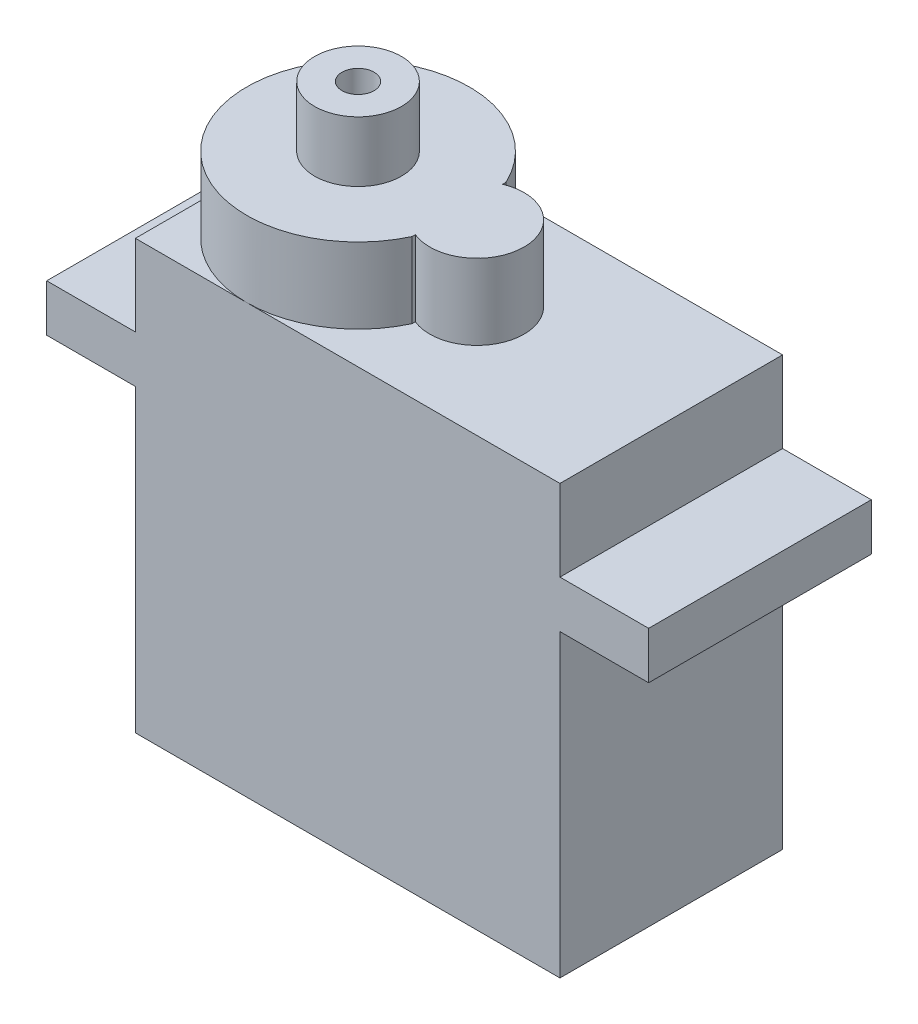
ISO-10303-21;
HEADER;
FILE_DESCRIPTION(('STEP AP214'),'2;1');
FILE_NAME('part.step','',(''),(''),'','','');
FILE_SCHEMA(('AUTOMOTIVE_DESIGN { 1 0 10303 214 1 1 1 1 }'));
ENDSEC;
DATA;
#1=APPLICATION_CONTEXT('core data for automotive mechanical design processes');
#2=APPLICATION_PROTOCOL_DEFINITION('international standard','automotive_design',2000,#1);
#3=PRODUCT_CONTEXT('',#1,'mechanical');
#4=PRODUCT('Part','Part','',(#3));
#5=PRODUCT_RELATED_PRODUCT_CATEGORY('part','',(#4));
#6=PRODUCT_DEFINITION_FORMATION('','',#4);
#7=PRODUCT_DEFINITION_CONTEXT('part definition',#1,'design');
#8=PRODUCT_DEFINITION('design','',#6,#7);
#9=PRODUCT_DEFINITION_SHAPE('','',#8);
#10=(LENGTH_UNIT() NAMED_UNIT(*) SI_UNIT(.MILLI.,.METRE.));
#11=(NAMED_UNIT(*) PLANE_ANGLE_UNIT() SI_UNIT($,.RADIAN.));
#12=(NAMED_UNIT(*) SI_UNIT($,.STERADIAN.) SOLID_ANGLE_UNIT());
#13=UNCERTAINTY_MEASURE_WITH_UNIT(LENGTH_MEASURE(1.E-05),#10,'distance_accuracy_value','');
#14=(GEOMETRIC_REPRESENTATION_CONTEXT(3) GLOBAL_UNCERTAINTY_ASSIGNED_CONTEXT((#13)) GLOBAL_UNIT_ASSIGNED_CONTEXT((#10,
#11,#12)) REPRESENTATION_CONTEXT('',''));
#15=CARTESIAN_POINT('',(0.,0.,0.));
#16=DIRECTION('',(0.,0.,1.));
#17=DIRECTION('',(1.,0.,0.));
#18=AXIS2_PLACEMENT_3D('',#15,#16,#17);
#19=CARTESIAN_POINT('',(0.,11.35,11.8));
#20=DIRECTION('',(0.,1.,0.));
#21=DIRECTION('',(0.,0.,1.));
#22=AXIS2_PLACEMENT_3D('',#19,#20,#21);
#23=PLANE('',#22);
#24=CARTESIAN_POINT('',(-5.35,11.35,5.9));
#25=DIRECTION('',(0.,1.,0.));
#26=DIRECTION('',(0.,0.,1.));
#27=AXIS2_PLACEMENT_3D('',#24,#25,#26);
#28=CIRCLE('',#27,5.9);
#29=CARTESIAN_POINT('',(-11.25,11.35,5.9));
#30=VERTEX_POINT('',#29);
#31=CARTESIAN_POINT('',(-5.35,11.35,11.8));
#32=VERTEX_POINT('',#31);
#33=EDGE_CURVE('E54',#30,#32,#28,.T.);
#34=ORIENTED_EDGE('',*,*,#33,.F.);
#35=DIRECTION('',(0.,0.,-1.));
#36=VECTOR('',#35,1.);
#37=CARTESIAN_POINT('',(-11.25,11.35,11.8));
#38=LINE('',#37,#36);
#39=CARTESIAN_POINT('',(-11.25,11.35,11.8));
#40=VERTEX_POINT('',#39);
#41=EDGE_CURVE('E181',#40,#30,#38,.T.);
#42=ORIENTED_EDGE('',*,*,#41,.F.);
#43=DIRECTION('',(1.,0.,0.));
#44=VECTOR('',#43,1.);
#45=CARTESIAN_POINT('',(0.,11.35,11.8));
#46=LINE('',#45,#44);
#47=EDGE_CURVE('E164',#40,#32,#46,.T.);
#48=ORIENTED_EDGE('',*,*,#47,.T.);
#49=EDGE_LOOP('',(#34,#42,#48));
#50=FACE_BOUND('',#49,.T.);
#51=ADVANCED_FACE('F45',(#50),#23,.T.);
#52=CARTESIAN_POINT('',(0.,11.35,8.38746859276656));
#53=VERTEX_POINT('',#52);
#54=EDGE_CURVE('E159',#32,#53,#28,.T.);
#55=ORIENTED_EDGE('',*,*,#54,.F.);
#56=CARTESIAN_POINT('',(11.25,11.35,11.8));
#57=VERTEX_POINT('',#56);
#58=EDGE_CURVE('E150',#32,#57,#46,.T.);
#59=ORIENTED_EDGE('',*,*,#58,.T.);
#60=DIRECTION('',(0.,0.,-1.));
#61=VECTOR('',#60,1.);
#62=CARTESIAN_POINT('',(11.25,11.35,11.8));
#63=LINE('',#62,#61);
#64=CARTESIAN_POINT('',(11.25,11.35,0.));
#65=VERTEX_POINT('',#64);
#66=EDGE_CURVE('E155',#57,#65,#63,.T.);
#67=ORIENTED_EDGE('',*,*,#66,.T.);
#68=DIRECTION('',(1.,0.,0.));
#69=VECTOR('',#68,1.);
#70=CARTESIAN_POINT('',(0.,11.35,0.));
#71=LINE('',#70,#69);
#72=CARTESIAN_POINT('',(-5.35,11.35,0.));
#73=VERTEX_POINT('',#72);
#74=EDGE_CURVE('E298',#73,#65,#71,.T.);
#75=ORIENTED_EDGE('',*,*,#74,.F.);
#76=CARTESIAN_POINT('',(0.,11.35,3.41253140723345));
#77=VERTEX_POINT('',#76);
#78=EDGE_CURVE('E223',#77,#73,#28,.T.);
#79=ORIENTED_EDGE('',*,*,#78,.F.);
#80=DIRECTION('',(0.,0.,1.));
#81=VECTOR('',#80,1.);
#82=CARTESIAN_POINT('',(0.,11.35,0.));
#83=LINE('',#82,#81);
#84=CARTESIAN_POINT('',(0.,11.35,3.58753378403056));
#85=VERTEX_POINT('',#84);
#86=EDGE_CURVE('E235',#77,#85,#83,.T.);
#87=ORIENTED_EDGE('',*,*,#86,.T.);
#88=CARTESIAN_POINT('',(0.949999999999996,11.35,5.9));
#89=DIRECTION('',(0.,1.,0.));
#90=DIRECTION('',(0.,0.,1.));
#91=AXIS2_PLACEMENT_3D('',#88,#89,#90);
#92=CIRCLE('',#91,2.5);
#93=CARTESIAN_POINT('',(0.,11.35,8.21246621596944));
#94=VERTEX_POINT('',#93);
#95=EDGE_CURVE('E61',#94,#85,#92,.T.);
#96=ORIENTED_EDGE('',*,*,#95,.F.);
#97=DIRECTION('',(0.,0.,1.));
#98=VECTOR('',#97,1.);
#99=CARTESIAN_POINT('',(0.,11.35,0.));
#100=LINE('',#99,#98);
#101=EDGE_CURVE('E234',#94,#53,#100,.T.);
#102=ORIENTED_EDGE('',*,*,#101,.T.);
#103=EDGE_LOOP('',(#55,#59,#67,#75,#79,#87,#96,#102));
#104=FACE_BOUND('',#103,.T.);
#105=ADVANCED_FACE('F152',(#104),#23,.T.);
#106=CARTESIAN_POINT('',(0.,7.05,11.8));
#107=DIRECTION('',(0.,1.,0.));
#108=DIRECTION('',(-1.,0.,0.));
#109=AXIS2_PLACEMENT_3D('',#106,#107,#108);
#110=PLANE('',#109);
#111=DIRECTION('',(1.,0.,0.));
#112=VECTOR('',#111,1.);
#113=CARTESIAN_POINT('',(0.,7.05,0.));
#114=LINE('',#113,#112);
#115=CARTESIAN_POINT('',(-15.95,7.05,0.));
#116=VERTEX_POINT('',#115);
#117=CARTESIAN_POINT('',(-11.25,7.05,0.));
#118=VERTEX_POINT('',#117);
#119=EDGE_CURVE('E265',#116,#118,#114,.T.);
#120=ORIENTED_EDGE('',*,*,#119,.F.);
#121=DIRECTION('',(0.,0.,-1.));
#122=VECTOR('',#121,1.);
#123=CARTESIAN_POINT('',(-15.95,7.05,11.8));
#124=LINE('',#123,#122);
#125=CARTESIAN_POINT('',(-15.95,7.05,11.8));
#126=VERTEX_POINT('',#125);
#127=EDGE_CURVE('E118',#126,#116,#124,.T.);
#128=ORIENTED_EDGE('',*,*,#127,.F.);
#129=DIRECTION('',(1.,0.,0.));
#130=VECTOR('',#129,1.);
#131=CARTESIAN_POINT('',(0.,7.05,11.8));
#132=LINE('',#131,#130);
#133=CARTESIAN_POINT('',(-11.25,7.05,11.8));
#134=VERTEX_POINT('',#133);
#135=EDGE_CURVE('E303',#126,#134,#132,.T.);
#136=ORIENTED_EDGE('',*,*,#135,.T.);
#137=DIRECTION('',(0.,0.,-1.));
#138=VECTOR('',#137,1.);
#139=CARTESIAN_POINT('',(-11.25,7.05,11.8));
#140=LINE('',#139,#138);
#141=EDGE_CURVE('E70',#134,#118,#140,.T.);
#142=ORIENTED_EDGE('',*,*,#141,.T.);
#143=EDGE_LOOP('',(#120,#128,#136,#142));
#144=FACE_BOUND('',#143,.T.);
#145=ADVANCED_FACE('F47',(#144),#110,.T.);
#146=CARTESIAN_POINT('',(-15.95,0.,11.8));
#147=DIRECTION('',(-1.,0.,0.));
#148=DIRECTION('',(0.,0.,1.));
#149=AXIS2_PLACEMENT_3D('',#146,#147,#148);
#150=PLANE('',#149);
#151=DIRECTION('',(0.,1.,0.));
#152=VECTOR('',#151,1.);
#153=CARTESIAN_POINT('',(-15.95,0.,0.));
#154=LINE('',#153,#152);
#155=CARTESIAN_POINT('',(-15.95,4.55,0.));
#156=VERTEX_POINT('',#155);
#157=EDGE_CURVE('E268',#156,#116,#154,.T.);
#158=ORIENTED_EDGE('',*,*,#157,.F.);
#159=DIRECTION('',(0.,0.,-1.));
#160=VECTOR('',#159,1.);
#161=CARTESIAN_POINT('',(-15.95,4.55,11.8));
#162=LINE('',#161,#160);
#163=CARTESIAN_POINT('',(-15.95,4.55,11.8));
#164=VERTEX_POINT('',#163);
#165=EDGE_CURVE('E213',#164,#156,#162,.T.);
#166=ORIENTED_EDGE('',*,*,#165,.F.);
#167=DIRECTION('',(0.,1.,0.));
#168=VECTOR('',#167,1.);
#169=CARTESIAN_POINT('',(-15.95,0.,11.8));
#170=LINE('',#169,#168);
#171=EDGE_CURVE('E306',#164,#126,#170,.T.);
#172=ORIENTED_EDGE('',*,*,#171,.T.);
#173=ORIENTED_EDGE('',*,*,#127,.T.);
#174=EDGE_LOOP('',(#158,#166,#172,#173));
#175=FACE_BOUND('',#174,.T.);
#176=ADVANCED_FACE('F451',(#175),#150,.T.);
#177=CARTESIAN_POINT('',(0.,4.55,11.8));
#178=DIRECTION('',(0.,-1.,0.));
#179=DIRECTION('',(1.,0.,0.));
#180=AXIS2_PLACEMENT_3D('',#177,#178,#179);
#181=PLANE('',#180);
#182=DIRECTION('',(-1.,0.,0.));
#183=VECTOR('',#182,1.);
#184=CARTESIAN_POINT('',(0.,4.55,0.));
#185=LINE('',#184,#183);
#186=CARTESIAN_POINT('',(-11.25,4.55,0.));
#187=VERTEX_POINT('',#186);
#188=EDGE_CURVE('E273',#187,#156,#185,.T.);
#189=ORIENTED_EDGE('',*,*,#188,.F.);
#190=DIRECTION('',(0.,0.,-1.));
#191=VECTOR('',#190,1.);
#192=CARTESIAN_POINT('',(-11.25,4.55,11.8));
#193=LINE('',#192,#191);
#194=CARTESIAN_POINT('',(-11.25,4.55,11.8));
#195=VERTEX_POINT('',#194);
#196=EDGE_CURVE('E210',#195,#187,#193,.T.);
#197=ORIENTED_EDGE('',*,*,#196,.F.);
#198=DIRECTION('',(-1.,0.,0.));
#199=VECTOR('',#198,1.);
#200=CARTESIAN_POINT('',(0.,4.55,11.8));
#201=LINE('',#200,#199);
#202=EDGE_CURVE('E309',#195,#164,#201,.T.);
#203=ORIENTED_EDGE('',*,*,#202,.T.);
#204=ORIENTED_EDGE('',*,*,#165,.T.);
#205=EDGE_LOOP('',(#189,#197,#203,#204));
#206=FACE_BOUND('',#205,.T.);
#207=ADVANCED_FACE('F448',(#206),#181,.T.);
#208=CARTESIAN_POINT('',(-11.25,0.,11.8));
#209=DIRECTION('',(-1.,0.,0.));
#210=DIRECTION('',(0.,0.,1.));
#211=AXIS2_PLACEMENT_3D('',#208,#209,#210);
#212=PLANE('',#211);
#213=DIRECTION('',(0.,1.,0.));
#214=VECTOR('',#213,1.);
#215=CARTESIAN_POINT('',(-11.25,0.,0.));
#216=LINE('',#215,#214);
#217=CARTESIAN_POINT('',(-11.25,-11.35,0.));
#218=VERTEX_POINT('',#217);
#219=EDGE_CURVE('E277',#218,#187,#216,.T.);
#220=ORIENTED_EDGE('',*,*,#219,.F.);
#221=DIRECTION('',(0.,0.,-1.));
#222=VECTOR('',#221,1.);
#223=CARTESIAN_POINT('',(-11.25,-11.35,11.8));
#224=LINE('',#223,#222);
#225=CARTESIAN_POINT('',(-11.25,-11.35,11.8));
#226=VERTEX_POINT('',#225);
#227=EDGE_CURVE('E207',#226,#218,#224,.T.);
#228=ORIENTED_EDGE('',*,*,#227,.F.);
#229=DIRECTION('',(0.,1.,0.));
#230=VECTOR('',#229,1.);
#231=CARTESIAN_POINT('',(-11.25,0.,11.8));
#232=LINE('',#231,#230);
#233=EDGE_CURVE('E317',#226,#195,#232,.T.);
#234=ORIENTED_EDGE('',*,*,#233,.T.);
#235=ORIENTED_EDGE('',*,*,#196,.T.);
#236=EDGE_LOOP('',(#220,#228,#234,#235));
#237=FACE_BOUND('',#236,.T.);
#238=ADVANCED_FACE('F444',(#237),#212,.T.);
#239=CARTESIAN_POINT('',(0.,-11.35,11.8));
#240=DIRECTION('',(0.,1.,0.));
#241=DIRECTION('',(0.,0.,1.));
#242=AXIS2_PLACEMENT_3D('',#239,#240,#241);
#243=PLANE('',#242);
#244=DIRECTION('',(1.,0.,0.));
#245=VECTOR('',#244,1.);
#246=CARTESIAN_POINT('',(0.,-11.35,0.));
#247=LINE('',#246,#245);
#248=CARTESIAN_POINT('',(11.25,-11.35,0.));
#249=VERTEX_POINT('',#248);
#250=EDGE_CURVE('E281',#218,#249,#247,.T.);
#251=ORIENTED_EDGE('',*,*,#250,.T.);
#252=DIRECTION('',(0.,0.,-1.));
#253=VECTOR('',#252,1.);
#254=CARTESIAN_POINT('',(11.25,-11.35,11.8));
#255=LINE('',#254,#253);
#256=CARTESIAN_POINT('',(11.25,-11.35,11.8));
#257=VERTEX_POINT('',#256);
#258=EDGE_CURVE('E203',#257,#249,#255,.T.);
#259=ORIENTED_EDGE('',*,*,#258,.F.);
#260=DIRECTION('',(1.,0.,0.));
#261=VECTOR('',#260,1.);
#262=CARTESIAN_POINT('',(0.,-11.35,11.8));
#263=LINE('',#262,#261);
#264=EDGE_CURVE('E321',#226,#257,#263,.T.);
#265=ORIENTED_EDGE('',*,*,#264,.F.);
#266=ORIENTED_EDGE('',*,*,#227,.T.);
#267=EDGE_LOOP('',(#251,#259,#265,#266));
#268=FACE_BOUND('',#267,.T.);
#269=ADVANCED_FACE('F440',(#268),#243,.F.);
#270=CARTESIAN_POINT('',(11.25,0.,11.8));
#271=DIRECTION('',(-1.,0.,0.));
#272=DIRECTION('',(0.,0.,1.));
#273=AXIS2_PLACEMENT_3D('',#270,#271,#272);
#274=PLANE('',#273);
#275=DIRECTION('',(0.,1.,0.));
#276=VECTOR('',#275,1.);
#277=CARTESIAN_POINT('',(11.25,0.,0.));
#278=LINE('',#277,#276);
#279=CARTESIAN_POINT('',(11.25,4.55,0.));
#280=VERTEX_POINT('',#279);
#281=EDGE_CURVE('E284',#249,#280,#278,.T.);
#282=ORIENTED_EDGE('',*,*,#281,.T.);
#283=DIRECTION('',(0.,0.,-1.));
#284=VECTOR('',#283,1.);
#285=CARTESIAN_POINT('',(11.25,4.55,11.8));
#286=LINE('',#285,#284);
#287=CARTESIAN_POINT('',(11.25,4.55,11.8));
#288=VERTEX_POINT('',#287);
#289=EDGE_CURVE('E199',#288,#280,#286,.T.);
#290=ORIENTED_EDGE('',*,*,#289,.F.);
#291=DIRECTION('',(0.,1.,0.));
#292=VECTOR('',#291,1.);
#293=CARTESIAN_POINT('',(11.25,0.,11.8));
#294=LINE('',#293,#292);
#295=EDGE_CURVE('E324',#257,#288,#294,.T.);
#296=ORIENTED_EDGE('',*,*,#295,.F.);
#297=ORIENTED_EDGE('',*,*,#258,.T.);
#298=EDGE_LOOP('',(#282,#290,#296,#297));
#299=FACE_BOUND('',#298,.T.);
#300=ADVANCED_FACE('F436',(#299),#274,.F.);
#301=CARTESIAN_POINT('',(0.,4.55,11.8));
#302=DIRECTION('',(0.,1.,0.));
#303=DIRECTION('',(0.,0.,1.));
#304=AXIS2_PLACEMENT_3D('',#301,#302,#303);
#305=PLANE('',#304);
#306=DIRECTION('',(1.,0.,0.));
#307=VECTOR('',#306,1.);
#308=CARTESIAN_POINT('',(0.,4.55,0.));
#309=LINE('',#308,#307);
#310=CARTESIAN_POINT('',(15.95,4.55,0.));
#311=VERTEX_POINT('',#310);
#312=EDGE_CURVE('E287',#280,#311,#309,.T.);
#313=ORIENTED_EDGE('',*,*,#312,.T.);
#314=DIRECTION('',(0.,0.,-1.));
#315=VECTOR('',#314,1.);
#316=CARTESIAN_POINT('',(15.95,4.55,11.8));
#317=LINE('',#316,#315);
#318=CARTESIAN_POINT('',(15.95,4.55,11.8));
#319=VERTEX_POINT('',#318);
#320=EDGE_CURVE('E195',#319,#311,#317,.T.);
#321=ORIENTED_EDGE('',*,*,#320,.F.);
#322=DIRECTION('',(1.,0.,0.));
#323=VECTOR('',#322,1.);
#324=CARTESIAN_POINT('',(0.,4.55,11.8));
#325=LINE('',#324,#323);
#326=EDGE_CURVE('E327',#288,#319,#325,.T.);
#327=ORIENTED_EDGE('',*,*,#326,.F.);
#328=ORIENTED_EDGE('',*,*,#289,.T.);
#329=EDGE_LOOP('',(#313,#321,#327,#328));
#330=FACE_BOUND('',#329,.T.);
#331=ADVANCED_FACE('F433',(#330),#305,.F.);
#332=CARTESIAN_POINT('',(15.95,0.,11.8));
#333=DIRECTION('',(-1.,0.,0.));
#334=DIRECTION('',(0.,0.,1.));
#335=AXIS2_PLACEMENT_3D('',#332,#333,#334);
#336=PLANE('',#335);
#337=DIRECTION('',(0.,1.,0.));
#338=VECTOR('',#337,1.);
#339=CARTESIAN_POINT('',(15.95,0.,0.));
#340=LINE('',#339,#338);
#341=CARTESIAN_POINT('',(15.95,7.05,0.));
#342=VERTEX_POINT('',#341);
#343=EDGE_CURVE('E290',#311,#342,#340,.T.);
#344=ORIENTED_EDGE('',*,*,#343,.T.);
#345=DIRECTION('',(0.,0.,-1.));
#346=VECTOR('',#345,1.);
#347=CARTESIAN_POINT('',(15.95,7.05,11.8));
#348=LINE('',#347,#346);
#349=CARTESIAN_POINT('',(15.95,7.05,11.8));
#350=VERTEX_POINT('',#349);
#351=EDGE_CURVE('E185',#350,#342,#348,.T.);
#352=ORIENTED_EDGE('',*,*,#351,.F.);
#353=DIRECTION('',(0.,1.,0.));
#354=VECTOR('',#353,1.);
#355=CARTESIAN_POINT('',(15.95,0.,11.8));
#356=LINE('',#355,#354);
#357=EDGE_CURVE('E330',#319,#350,#356,.T.);
#358=ORIENTED_EDGE('',*,*,#357,.F.);
#359=ORIENTED_EDGE('',*,*,#320,.T.);
#360=EDGE_LOOP('',(#344,#352,#358,#359));
#361=FACE_BOUND('',#360,.T.);
#362=ADVANCED_FACE('F339',(#361),#336,.F.);
#363=CARTESIAN_POINT('',(0.,7.05,11.8));
#364=DIRECTION('',(0.,-1.,0.));
#365=DIRECTION('',(1.,0.,0.));
#366=AXIS2_PLACEMENT_3D('',#363,#364,#365);
#367=PLANE('',#366);
#368=DIRECTION('',(-1.,0.,0.));
#369=VECTOR('',#368,1.);
#370=CARTESIAN_POINT('',(0.,7.05,0.));
#371=LINE('',#370,#369);
#372=CARTESIAN_POINT('',(11.25,7.05,0.));
#373=VERTEX_POINT('',#372);
#374=EDGE_CURVE('E293',#342,#373,#371,.T.);
#375=ORIENTED_EDGE('',*,*,#374,.T.);
#376=DIRECTION('',(0.,0.,-1.));
#377=VECTOR('',#376,1.);
#378=CARTESIAN_POINT('',(11.25,7.05,11.8));
#379=LINE('',#378,#377);
#380=CARTESIAN_POINT('',(11.25,7.05,11.8));
#381=VERTEX_POINT('',#380);
#382=EDGE_CURVE('E180',#381,#373,#379,.T.);
#383=ORIENTED_EDGE('',*,*,#382,.F.);
#384=DIRECTION('',(-1.,0.,0.));
#385=VECTOR('',#384,1.);
#386=CARTESIAN_POINT('',(0.,7.05,11.8));
#387=LINE('',#386,#385);
#388=EDGE_CURVE('E170',#350,#381,#387,.T.);
#389=ORIENTED_EDGE('',*,*,#388,.F.);
#390=ORIENTED_EDGE('',*,*,#351,.T.);
#391=EDGE_LOOP('',(#375,#383,#389,#390));
#392=FACE_BOUND('',#391,.T.);
#393=ADVANCED_FACE('F343',(#392),#367,.F.);
#394=CARTESIAN_POINT('',(11.25,0.,11.8));
#395=DIRECTION('',(-1.,0.,0.));
#396=DIRECTION('',(0.,0.,1.));
#397=AXIS2_PLACEMENT_3D('',#394,#395,#396);
#398=PLANE('',#397);
#399=DIRECTION('',(0.,1.,0.));
#400=VECTOR('',#399,1.);
#401=CARTESIAN_POINT('',(11.25,0.,0.));
#402=LINE('',#401,#400);
#403=EDGE_CURVE('E178',#373,#65,#402,.T.);
#404=ORIENTED_EDGE('',*,*,#403,.T.);
#405=ORIENTED_EDGE('',*,*,#66,.F.);
#406=DIRECTION('',(0.,1.,0.));
#407=VECTOR('',#406,1.);
#408=CARTESIAN_POINT('',(11.25,0.,11.8));
#409=LINE('',#408,#407);
#410=EDGE_CURVE('E165',#381,#57,#409,.T.);
#411=ORIENTED_EDGE('',*,*,#410,.F.);
#412=ORIENTED_EDGE('',*,*,#382,.T.);
#413=EDGE_LOOP('',(#404,#405,#411,#412));
#414=FACE_BOUND('',#413,.T.);
#415=ADVANCED_FACE('F176',(#414),#398,.F.);
#416=EDGE_CURVE('E216',#73,#30,#28,.T.);
#417=ORIENTED_EDGE('',*,*,#416,.F.);
#418=CARTESIAN_POINT('',(-11.25,11.35,0.));
#419=VERTEX_POINT('',#418);
#420=EDGE_CURVE('E254',#419,#73,#71,.T.);
#421=ORIENTED_EDGE('',*,*,#420,.F.);
#422=EDGE_CURVE('E188',#30,#419,#38,.T.);
#423=ORIENTED_EDGE('',*,*,#422,.F.);
#424=EDGE_LOOP('',(#417,#421,#423));
#425=FACE_BOUND('',#424,.T.);
#426=ADVANCED_FACE('F252',(#425),#23,.T.);
#427=CARTESIAN_POINT('',(-11.25,0.,11.8));
#428=DIRECTION('',(-1.,0.,0.));
#429=DIRECTION('',(0.,0.,1.));
#430=AXIS2_PLACEMENT_3D('',#427,#428,#429);
#431=PLANE('',#430);
#432=DIRECTION('',(0.,1.,0.));
#433=VECTOR('',#432,1.);
#434=CARTESIAN_POINT('',(-11.25,0.,0.));
#435=LINE('',#434,#433);
#436=EDGE_CURVE('E301',#118,#419,#435,.T.);
#437=ORIENTED_EDGE('',*,*,#436,.F.);
#438=ORIENTED_EDGE('',*,*,#141,.F.);
#439=DIRECTION('',(0.,1.,0.));
#440=VECTOR('',#439,1.);
#441=CARTESIAN_POINT('',(-11.25,0.,11.8));
#442=LINE('',#441,#440);
#443=EDGE_CURVE('E259',#134,#40,#442,.T.);
#444=ORIENTED_EDGE('',*,*,#443,.T.);
#445=ORIENTED_EDGE('',*,*,#41,.T.);
#446=ORIENTED_EDGE('',*,*,#422,.T.);
#447=EDGE_LOOP('',(#437,#438,#444,#445,#446));
#448=FACE_BOUND('',#447,.T.);
#449=ADVANCED_FACE('F257',(#448),#431,.T.);
#450=CARTESIAN_POINT('',(0.,0.,11.8));
#451=DIRECTION('',(0.,0.,1.));
#452=DIRECTION('',(1.,0.,0.));
#453=AXIS2_PLACEMENT_3D('',#450,#451,#452);
#454=PLANE('',#453);
#455=ORIENTED_EDGE('',*,*,#135,.F.);
#456=ORIENTED_EDGE('',*,*,#171,.F.);
#457=ORIENTED_EDGE('',*,*,#202,.F.);
#458=ORIENTED_EDGE('',*,*,#233,.F.);
#459=ORIENTED_EDGE('',*,*,#264,.T.);
#460=ORIENTED_EDGE('',*,*,#295,.T.);
#461=ORIENTED_EDGE('',*,*,#326,.T.);
#462=ORIENTED_EDGE('',*,*,#357,.T.);
#463=ORIENTED_EDGE('',*,*,#388,.T.);
#464=ORIENTED_EDGE('',*,*,#410,.T.);
#465=ORIENTED_EDGE('',*,*,#58,.F.);
#466=ORIENTED_EDGE('',*,*,#47,.F.);
#467=ORIENTED_EDGE('',*,*,#443,.F.);
#468=EDGE_LOOP('',(#455,#456,#457,#458,#459,#460,#461,#462,#463,#464,#465,#466,#467));
#469=FACE_BOUND('',#468,.T.);
#470=ADVANCED_FACE('F168',(#469),#454,.T.);
#471=CARTESIAN_POINT('',(0.,0.,0.));
#472=DIRECTION('',(0.,0.,1.));
#473=DIRECTION('',(1.,0.,0.));
#474=AXIS2_PLACEMENT_3D('',#471,#472,#473);
#475=PLANE('',#474);
#476=ORIENTED_EDGE('',*,*,#119,.T.);
#477=ORIENTED_EDGE('',*,*,#436,.T.);
#478=ORIENTED_EDGE('',*,*,#420,.T.);
#479=ORIENTED_EDGE('',*,*,#74,.T.);
#480=ORIENTED_EDGE('',*,*,#403,.F.);
#481=ORIENTED_EDGE('',*,*,#374,.F.);
#482=ORIENTED_EDGE('',*,*,#343,.F.);
#483=ORIENTED_EDGE('',*,*,#312,.F.);
#484=ORIENTED_EDGE('',*,*,#281,.F.);
#485=ORIENTED_EDGE('',*,*,#250,.F.);
#486=ORIENTED_EDGE('',*,*,#219,.T.);
#487=ORIENTED_EDGE('',*,*,#188,.T.);
#488=ORIENTED_EDGE('',*,*,#157,.T.);
#489=EDGE_LOOP('',(#476,#477,#478,#479,#480,#481,#482,#483,#484,#485,#486,#487,#488));
#490=FACE_BOUND('',#489,.T.);
#491=ADVANCED_FACE('F344',(#490),#475,.F.);
#492=CARTESIAN_POINT('',(0.949999999999996,15.35,5.9));
#493=DIRECTION('',(0.,-1.,0.));
#494=DIRECTION('',(0.,0.,-1.));
#495=AXIS2_PLACEMENT_3D('',#492,#493,#494);
#496=CYLINDRICAL_SURFACE('',#495,2.5);
#497=ORIENTED_EDGE('',*,*,#95,.T.);
#498=DIRECTION('',(0.,-1.,0.));
#499=VECTOR('',#498,1.);
#500=CARTESIAN_POINT('',(0.,15.35,3.58753378403056));
#501=LINE('',#500,#499);
#502=CARTESIAN_POINT('',(0.,15.35,3.58753378403056));
#503=VERTEX_POINT('',#502);
#504=EDGE_CURVE('E269',#503,#85,#501,.T.);
#505=ORIENTED_EDGE('',*,*,#504,.F.);
#506=CARTESIAN_POINT('',(0.949999999999996,15.35,5.9));
#507=DIRECTION('',(0.,1.,0.));
#508=DIRECTION('',(0.,0.,1.));
#509=AXIS2_PLACEMENT_3D('',#506,#507,#508);
#510=CIRCLE('',#509,2.5);
#511=CARTESIAN_POINT('',(0.,15.35,8.21246621596944));
#512=VERTEX_POINT('',#511);
#513=EDGE_CURVE('E241',#512,#503,#510,.T.);
#514=ORIENTED_EDGE('',*,*,#513,.F.);
#515=DIRECTION('',(0.,-1.,0.));
#516=VECTOR('',#515,1.);
#517=CARTESIAN_POINT('',(0.,15.35,8.21246621596944));
#518=LINE('',#517,#516);
#519=EDGE_CURVE('E352',#512,#94,#518,.T.);
#520=ORIENTED_EDGE('',*,*,#519,.T.);
#521=EDGE_LOOP('',(#497,#505,#514,#520));
#522=FACE_BOUND('',#521,.T.);
#523=ADVANCED_FACE('F512',(#522),#496,.T.);
#524=CARTESIAN_POINT('',(0.,15.35,0.));
#525=DIRECTION('',(1.,0.,0.));
#526=DIRECTION('',(0.,0.,-1.));
#527=AXIS2_PLACEMENT_3D('',#524,#525,#526);
#528=PLANE('',#527);
#529=ORIENTED_EDGE('',*,*,#86,.F.);
#530=DIRECTION('',(0.,-1.,0.));
#531=VECTOR('',#530,1.);
#532=CARTESIAN_POINT('',(0.,15.35,3.41253140723345));
#533=LINE('',#532,#531);
#534=CARTESIAN_POINT('',(0.,15.35,3.41253140723345));
#535=VERTEX_POINT('',#534);
#536=EDGE_CURVE('E348',#535,#77,#533,.T.);
#537=ORIENTED_EDGE('',*,*,#536,.F.);
#538=DIRECTION('',(0.,0.,1.));
#539=VECTOR('',#538,1.);
#540=CARTESIAN_POINT('',(0.,15.35,0.));
#541=LINE('',#540,#539);
#542=EDGE_CURVE('E363',#535,#503,#541,.T.);
#543=ORIENTED_EDGE('',*,*,#542,.T.);
#544=ORIENTED_EDGE('',*,*,#504,.T.);
#545=EDGE_LOOP('',(#529,#537,#543,#544));
#546=FACE_BOUND('',#545,.T.);
#547=ADVANCED_FACE('F522',(#546),#528,.T.);
#548=CARTESIAN_POINT('',(-5.35,15.35,5.9));
#549=DIRECTION('',(0.,-1.,0.));
#550=DIRECTION('',(0.,0.,-1.));
#551=AXIS2_PLACEMENT_3D('',#548,#549,#550);
#552=CYLINDRICAL_SURFACE('',#551,5.9);
#553=ORIENTED_EDGE('',*,*,#78,.T.);
#554=ORIENTED_EDGE('',*,*,#416,.T.);
#555=ORIENTED_EDGE('',*,*,#33,.T.);
#556=ORIENTED_EDGE('',*,*,#54,.T.);
#557=DIRECTION('',(0.,-1.,0.));
#558=VECTOR('',#557,1.);
#559=CARTESIAN_POINT('',(0.,15.35,8.38746859276656));
#560=LINE('',#559,#558);
#561=CARTESIAN_POINT('',(0.,15.35,8.38746859276656));
#562=VERTEX_POINT('',#561);
#563=EDGE_CURVE('E350',#562,#53,#560,.T.);
#564=ORIENTED_EDGE('',*,*,#563,.F.);
#565=CARTESIAN_POINT('',(-5.35,15.35,5.9));
#566=DIRECTION('',(0.,1.,0.));
#567=DIRECTION('',(0.,0.,1.));
#568=AXIS2_PLACEMENT_3D('',#565,#566,#567);
#569=CIRCLE('',#568,5.9);
#570=EDGE_CURVE('E359',#535,#562,#569,.T.);
#571=ORIENTED_EDGE('',*,*,#570,.F.);
#572=ORIENTED_EDGE('',*,*,#536,.T.);
#573=EDGE_LOOP('',(#553,#554,#555,#556,#564,#571,#572));
#574=FACE_BOUND('',#573,.T.);
#575=ADVANCED_FACE('F244',(#574),#552,.T.);
#576=CARTESIAN_POINT('',(0.,15.35,0.));
#577=DIRECTION('',(1.,0.,0.));
#578=DIRECTION('',(0.,0.,-1.));
#579=AXIS2_PLACEMENT_3D('',#576,#577,#578);
#580=PLANE('',#579);
#581=ORIENTED_EDGE('',*,*,#101,.F.);
#582=ORIENTED_EDGE('',*,*,#519,.F.);
#583=DIRECTION('',(0.,0.,1.));
#584=VECTOR('',#583,1.);
#585=CARTESIAN_POINT('',(0.,15.35,0.));
#586=LINE('',#585,#584);
#587=EDGE_CURVE('E355',#512,#562,#586,.T.);
#588=ORIENTED_EDGE('',*,*,#587,.T.);
#589=ORIENTED_EDGE('',*,*,#563,.T.);
#590=EDGE_LOOP('',(#581,#582,#588,#589));
#591=FACE_BOUND('',#590,.T.);
#592=ADVANCED_FACE('F399',(#591),#580,.T.);
#593=CARTESIAN_POINT('',(0.,15.35,0.));
#594=DIRECTION('',(0.,1.,0.));
#595=DIRECTION('',(0.,0.,1.));
#596=AXIS2_PLACEMENT_3D('',#593,#594,#595);
#597=PLANE('',#596);
#598=CARTESIAN_POINT('',(-5.35,15.35,5.9));
#599=DIRECTION('',(0.,1.,0.));
#600=DIRECTION('',(0.,0.,1.));
#601=AXIS2_PLACEMENT_3D('',#598,#599,#600);
#602=CIRCLE('',#601,2.3);
#603=CARTESIAN_POINT('',(-5.35,15.35,8.2));
#604=VERTEX_POINT('',#603);
#605=EDGE_CURVE('E376',#604,#604,#602,.T.);
#606=ORIENTED_EDGE('',*,*,#605,.F.);
#607=EDGE_LOOP('',(#606));
#608=FACE_BOUND('',#607,.T.);
#609=ORIENTED_EDGE('',*,*,#513,.T.);
#610=ORIENTED_EDGE('',*,*,#542,.F.);
#611=ORIENTED_EDGE('',*,*,#570,.T.);
#612=ORIENTED_EDGE('',*,*,#587,.F.);
#613=EDGE_LOOP('',(#609,#610,#611,#612));
#614=FACE_BOUND('',#613,.T.);
#615=ADVANCED_FACE('F397',(#608,#614),#597,.T.);
#616=CARTESIAN_POINT('',(-5.35,18.55,5.9));
#617=DIRECTION('',(0.,-1.,0.));
#618=DIRECTION('',(0.,0.,-1.));
#619=AXIS2_PLACEMENT_3D('',#616,#617,#618);
#620=CYLINDRICAL_SURFACE('',#619,2.3);
#621=CARTESIAN_POINT('',(-5.35,18.55,5.9));
#622=DIRECTION('',(0.,1.,0.));
#623=DIRECTION('',(0.,0.,1.));
#624=AXIS2_PLACEMENT_3D('',#621,#622,#623);
#625=CIRCLE('',#624,2.3);
#626=CARTESIAN_POINT('',(-5.35,18.55,8.2));
#627=VERTEX_POINT('',#626);
#628=EDGE_CURVE('E383',#627,#627,#625,.T.);
#629=ORIENTED_EDGE('',*,*,#628,.F.);
#630=EDGE_LOOP('',(#629));
#631=FACE_BOUND('',#630,.T.);
#632=ORIENTED_EDGE('',*,*,#605,.T.);
#633=EDGE_LOOP('',(#632));
#634=FACE_BOUND('',#633,.T.);
#635=ADVANCED_FACE('F395',(#631,#634),#620,.T.);
#636=CARTESIAN_POINT('',(-5.35,18.55,5.9));
#637=DIRECTION('',(0.,-1.,0.));
#638=DIRECTION('',(0.,0.,-1.));
#639=AXIS2_PLACEMENT_3D('',#636,#637,#638);
#640=CYLINDRICAL_SURFACE('',#639,0.85);
#641=CARTESIAN_POINT('',(-5.35,18.55,5.9));
#642=DIRECTION('',(0.,1.,0.));
#643=DIRECTION('',(0.,0.,1.));
#644=AXIS2_PLACEMENT_3D('',#641,#642,#643);
#645=CIRCLE('',#644,0.85);
#646=CARTESIAN_POINT('',(-5.35,18.55,6.75));
#647=VERTEX_POINT('',#646);
#648=EDGE_CURVE('E380',#647,#647,#645,.T.);
#649=ORIENTED_EDGE('',*,*,#648,.T.);
#650=EDGE_LOOP('',(#649));
#651=FACE_BOUND('',#650,.T.);
#652=CARTESIAN_POINT('',(-5.35,15.35,5.9));
#653=DIRECTION('',(0.,1.,0.));
#654=DIRECTION('',(0.,0.,1.));
#655=AXIS2_PLACEMENT_3D('',#652,#653,#654);
#656=CIRCLE('',#655,0.85);
#657=CARTESIAN_POINT('',(-5.35,15.35,6.75));
#658=VERTEX_POINT('',#657);
#659=EDGE_CURVE('E11',#658,#658,#656,.F.);
#660=ORIENTED_EDGE('',*,*,#659,.T.);
#661=EDGE_LOOP('',(#660));
#662=FACE_BOUND('',#661,.T.);
#663=ADVANCED_FACE('F406',(#651,#662),#640,.F.);
#664=CARTESIAN_POINT('',(0.,18.55,0.));
#665=DIRECTION('',(0.,1.,0.));
#666=DIRECTION('',(0.,0.,1.));
#667=AXIS2_PLACEMENT_3D('',#664,#665,#666);
#668=PLANE('',#667);
#669=ORIENTED_EDGE('',*,*,#628,.T.);
#670=EDGE_LOOP('',(#669));
#671=FACE_BOUND('',#670,.T.);
#672=ORIENTED_EDGE('',*,*,#648,.F.);
#673=EDGE_LOOP('',(#672));
#674=FACE_BOUND('',#673,.T.);
#675=ADVANCED_FACE('F412',(#671,#674),#668,.T.);
#676=ORIENTED_EDGE('',*,*,#659,.F.);
#677=EDGE_LOOP('',(#676));
#678=FACE_BOUND('',#677,.T.);
#679=ADVANCED_FACE('F401',(#678),#597,.T.);
#680=CLOSED_SHELL('',(#51,#105,#145,#176,#207,#238,#269,#300,#331,#362,#393,#415,#426,#449,#470,
#491,#523,#547,#575,#592,#615,#635,#663,#675,#679));
#681=MANIFOLD_SOLID_BREP('B2',#680);
#682=ADVANCED_BREP_SHAPE_REPRESENTATION('',(#18,#681),#14);
#683=SHAPE_DEFINITION_REPRESENTATION(#9,#682);
ENDSEC;
END-ISO-10303-21;
